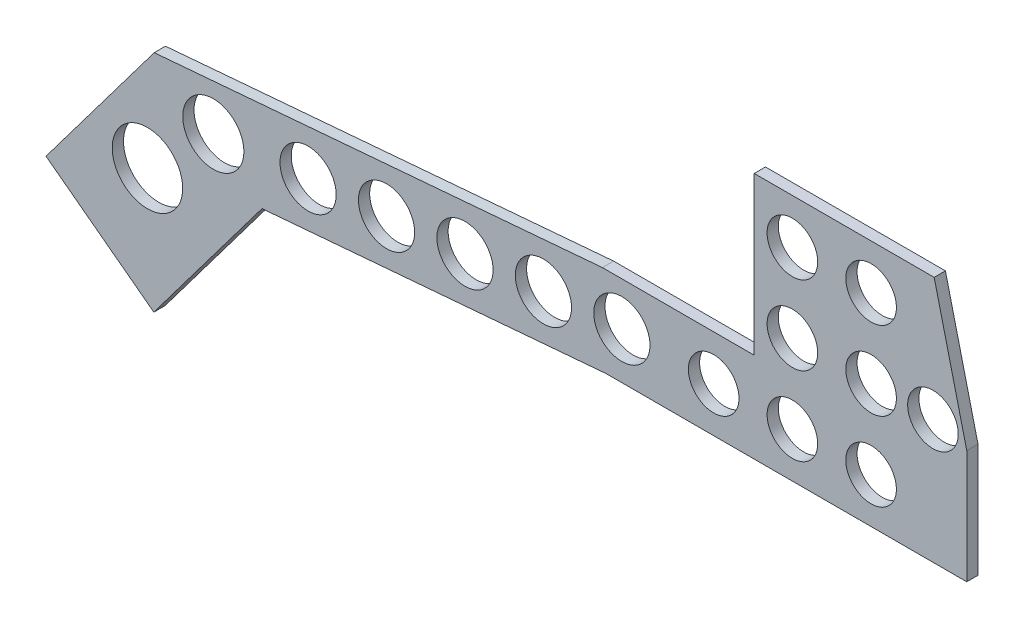
ISO-10303-21;
HEADER;
FILE_DESCRIPTION(('STEP AP214'),'2;1');
FILE_NAME('part.step','',(''),(''),'','','');
FILE_SCHEMA(('AUTOMOTIVE_DESIGN { 1 0 10303 214 1 1 1 1 }'));
ENDSEC;
DATA;
#1=APPLICATION_CONTEXT('core data for automotive mechanical design processes');
#2=APPLICATION_PROTOCOL_DEFINITION('international standard','automotive_design',2000,#1);
#3=PRODUCT_CONTEXT('',#1,'mechanical');
#4=PRODUCT('Part','Part','',(#3));
#5=PRODUCT_RELATED_PRODUCT_CATEGORY('part','',(#4));
#6=PRODUCT_DEFINITION_FORMATION('','',#4);
#7=PRODUCT_DEFINITION_CONTEXT('part definition',#1,'design');
#8=PRODUCT_DEFINITION('design','',#6,#7);
#9=PRODUCT_DEFINITION_SHAPE('','',#8);
#10=(LENGTH_UNIT() NAMED_UNIT(*) SI_UNIT(.MILLI.,.METRE.));
#11=(NAMED_UNIT(*) PLANE_ANGLE_UNIT() SI_UNIT($,.RADIAN.));
#12=(NAMED_UNIT(*) SI_UNIT($,.STERADIAN.) SOLID_ANGLE_UNIT());
#13=UNCERTAINTY_MEASURE_WITH_UNIT(LENGTH_MEASURE(1.E-05),#10,'distance_accuracy_value','');
#14=(GEOMETRIC_REPRESENTATION_CONTEXT(3) GLOBAL_UNCERTAINTY_ASSIGNED_CONTEXT((#13)) GLOBAL_UNIT_ASSIGNED_CONTEXT((#10,
#11,#12)) REPRESENTATION_CONTEXT('',''));
#15=CARTESIAN_POINT('',(0.,0.,0.));
#16=DIRECTION('',(0.,0.,1.));
#17=DIRECTION('',(1.,0.,0.));
#18=AXIS2_PLACEMENT_3D('',#15,#16,#17);
#19=CARTESIAN_POINT('',(-169.514196693188,-118.676834610208,3.175));
#20=DIRECTION('',(-0.601328641816421,-0.799001792570716,0.));
#21=DIRECTION('',(0.799001792570717,-0.601328641816421,0.));
#22=AXIS2_PLACEMENT_3D('',#19,#20,#21);
#23=PLANE('',#22);
#24=DIRECTION('',(-0.799001792570716,0.601328641816421,0.));
#25=VECTOR('',#24,1.);
#26=CARTESIAN_POINT('',(-169.514196693188,-118.676834610208,0.));
#27=LINE('',#26,#25);
#28=CARTESIAN_POINT('',(-169.514196693188,-118.676834610208,0.));
#29=VERTEX_POINT('',#28);
#30=CARTESIAN_POINT('',(-199.956164990132,-95.7662133570028,0.));
#31=VERTEX_POINT('',#30);
#32=EDGE_CURVE('E151',#29,#31,#27,.T.);
#33=ORIENTED_EDGE('',*,*,#32,.F.);
#34=DIRECTION('',(0.,0.,-1.));
#35=VECTOR('',#34,1.);
#36=CARTESIAN_POINT('',(-169.514196693188,-118.676834610208,3.175));
#37=LINE('',#36,#35);
#38=CARTESIAN_POINT('',(-169.514196693188,-118.676834610208,3.175));
#39=VERTEX_POINT('',#38);
#40=EDGE_CURVE('E11',#39,#29,#37,.T.);
#41=ORIENTED_EDGE('',*,*,#40,.F.);
#42=DIRECTION('',(-0.799001792570716,0.601328641816421,0.));
#43=VECTOR('',#42,1.);
#44=CARTESIAN_POINT('',(-169.514196693188,-118.676834610208,3.175));
#45=LINE('',#44,#43);
#46=CARTESIAN_POINT('',(-199.956164990132,-95.7662133570028,3.175));
#47=VERTEX_POINT('',#46);
#48=EDGE_CURVE('E181',#39,#47,#45,.T.);
#49=ORIENTED_EDGE('',*,*,#48,.T.);
#50=DIRECTION('',(0.,0.,-1.));
#51=VECTOR('',#50,1.);
#52=CARTESIAN_POINT('',(-199.956164990132,-95.7662133570028,3.175));
#53=LINE('',#52,#51);
#54=EDGE_CURVE('E39',#47,#31,#53,.T.);
#55=ORIENTED_EDGE('',*,*,#54,.T.);
#56=EDGE_LOOP('',(#33,#41,#49,#55));
#57=FACE_BOUND('',#56,.T.);
#58=ADVANCED_FACE('F36',(#57),#23,.T.);
#59=CARTESIAN_POINT('',(-138.966701688914,-78.087543547616,3.175));
#60=DIRECTION('',(0.799001792570717,-0.601328641816421,0.));
#61=DIRECTION('',(0.601328641816421,0.799001792570717,0.));
#62=AXIS2_PLACEMENT_3D('',#59,#60,#61);
#63=PLANE('',#62);
#64=DIRECTION('',(-0.601328641816421,-0.799001792570717,0.));
#65=VECTOR('',#64,1.);
#66=CARTESIAN_POINT('',(-138.966701688914,-78.087543547616,0.));
#67=LINE('',#66,#65);
#68=CARTESIAN_POINT('',(-138.966701688914,-78.087543547616,0.));
#69=VERTEX_POINT('',#68);
#70=EDGE_CURVE('E179',#69,#29,#67,.T.);
#71=ORIENTED_EDGE('',*,*,#70,.F.);
#72=DIRECTION('',(0.,0.,-1.));
#73=VECTOR('',#72,1.);
#74=CARTESIAN_POINT('',(-138.966701688914,-78.087543547616,3.175));
#75=LINE('',#74,#73);
#76=CARTESIAN_POINT('',(-138.966701688914,-78.087543547616,3.175));
#77=VERTEX_POINT('',#76);
#78=EDGE_CURVE('E45',#77,#69,#75,.T.);
#79=ORIENTED_EDGE('',*,*,#78,.F.);
#80=DIRECTION('',(-0.601328641816421,-0.799001792570717,0.));
#81=VECTOR('',#80,1.);
#82=CARTESIAN_POINT('',(-138.966701688914,-78.087543547616,3.175));
#83=LINE('',#82,#81);
#84=EDGE_CURVE('E141',#77,#39,#83,.T.);
#85=ORIENTED_EDGE('',*,*,#84,.T.);
#86=ORIENTED_EDGE('',*,*,#40,.T.);
#87=EDGE_LOOP('',(#71,#79,#85,#86));
#88=FACE_BOUND('',#87,.T.);
#89=ADVANCED_FACE('F199',(#88),#63,.T.);
#90=CARTESIAN_POINT('',(-41.787887726057,-69.85,3.175));
#91=DIRECTION('',(0.0844639550740975,-0.996426535321717,0.));
#92=DIRECTION('',(0.996426535321717,0.0844639550740975,0.));
#93=AXIS2_PLACEMENT_3D('',#90,#91,#92);
#94=PLANE('',#93);
#95=DIRECTION('',(-0.996426535321717,-0.0844639550740975,0.));
#96=VECTOR('',#95,1.);
#97=CARTESIAN_POINT('',(-41.787887726057,-69.85,0.));
#98=LINE('',#97,#96);
#99=CARTESIAN_POINT('',(-41.787887726057,-69.85,0.));
#100=VERTEX_POINT('',#99);
#101=EDGE_CURVE('E128',#100,#69,#98,.T.);
#102=ORIENTED_EDGE('',*,*,#101,.F.);
#103=DIRECTION('',(0.,0.,-1.));
#104=VECTOR('',#103,1.);
#105=CARTESIAN_POINT('',(-41.787887726057,-69.85,3.175));
#106=LINE('',#105,#104);
#107=CARTESIAN_POINT('',(-41.787887726057,-69.85,3.175));
#108=VERTEX_POINT('',#107);
#109=EDGE_CURVE('E123',#108,#100,#106,.T.);
#110=ORIENTED_EDGE('',*,*,#109,.F.);
#111=DIRECTION('',(-0.996426535321717,-0.0844639550740975,0.));
#112=VECTOR('',#111,1.);
#113=CARTESIAN_POINT('',(-41.787887726057,-69.85,3.175));
#114=LINE('',#113,#112);
#115=EDGE_CURVE('E126',#108,#77,#114,.T.);
#116=ORIENTED_EDGE('',*,*,#115,.T.);
#117=ORIENTED_EDGE('',*,*,#78,.T.);
#118=EDGE_LOOP('',(#102,#110,#116,#117));
#119=FACE_BOUND('',#118,.T.);
#120=ADVANCED_FACE('F125',(#119),#94,.T.);
#121=CARTESIAN_POINT('',(60.,-69.85,3.175));
#122=DIRECTION('',(0.,-1.,0.));
#123=DIRECTION('',(0.,0.,-1.));
#124=AXIS2_PLACEMENT_3D('',#121,#122,#123);
#125=PLANE('',#124);
#126=DIRECTION('',(-1.,0.,0.));
#127=VECTOR('',#126,1.);
#128=CARTESIAN_POINT('',(60.,-69.85,0.));
#129=LINE('',#128,#127);
#130=CARTESIAN_POINT('',(60.,-69.85,0.));
#131=VERTEX_POINT('',#130);
#132=EDGE_CURVE('E176',#131,#100,#129,.T.);
#133=ORIENTED_EDGE('',*,*,#132,.F.);
#134=DIRECTION('',(0.,0.,-1.));
#135=VECTOR('',#134,1.);
#136=CARTESIAN_POINT('',(60.,-69.85,3.175));
#137=LINE('',#136,#135);
#138=CARTESIAN_POINT('',(60.,-69.85,3.175));
#139=VERTEX_POINT('',#138);
#140=EDGE_CURVE('E133',#139,#131,#137,.T.);
#141=ORIENTED_EDGE('',*,*,#140,.F.);
#142=DIRECTION('',(-1.,0.,0.));
#143=VECTOR('',#142,1.);
#144=CARTESIAN_POINT('',(60.,-69.85,3.175));
#145=LINE('',#144,#143);
#146=EDGE_CURVE('E139',#139,#108,#145,.T.);
#147=ORIENTED_EDGE('',*,*,#146,.T.);
#148=ORIENTED_EDGE('',*,*,#109,.T.);
#149=EDGE_LOOP('',(#133,#141,#147,#148));
#150=FACE_BOUND('',#149,.T.);
#151=ADVANCED_FACE('F143',(#150),#125,.T.);
#152=CARTESIAN_POINT('',(60.,-37.7540856031128,3.175));
#153=DIRECTION('',(1.,0.,0.));
#154=DIRECTION('',(0.,1.,0.));
#155=AXIS2_PLACEMENT_3D('',#152,#153,#154);
#156=PLANE('',#155);
#157=DIRECTION('',(0.,-1.,0.));
#158=VECTOR('',#157,1.);
#159=CARTESIAN_POINT('',(60.,-37.7540856031128,0.));
#160=LINE('',#159,#158);
#161=CARTESIAN_POINT('',(60.,-37.7540856031128,0.));
#162=VERTEX_POINT('',#161);
#163=EDGE_CURVE('E173',#162,#131,#160,.T.);
#164=ORIENTED_EDGE('',*,*,#163,.F.);
#165=DIRECTION('',(0.,0.,-1.));
#166=VECTOR('',#165,1.);
#167=CARTESIAN_POINT('',(60.,-37.7540856031128,3.175));
#168=LINE('',#167,#166);
#169=CARTESIAN_POINT('',(60.,-37.7540856031128,3.175));
#170=VERTEX_POINT('',#169);
#171=EDGE_CURVE('E185',#170,#162,#168,.T.);
#172=ORIENTED_EDGE('',*,*,#171,.F.);
#173=DIRECTION('',(0.,-1.,0.));
#174=VECTOR('',#173,1.);
#175=CARTESIAN_POINT('',(60.,-37.7540856031128,3.175));
#176=LINE('',#175,#174);
#177=EDGE_CURVE('E144',#170,#139,#176,.T.);
#178=ORIENTED_EDGE('',*,*,#177,.T.);
#179=ORIENTED_EDGE('',*,*,#140,.T.);
#180=EDGE_LOOP('',(#164,#172,#178,#179));
#181=FACE_BOUND('',#180,.T.);
#182=ADVANCED_FACE('F212',(#181),#156,.T.);
#183=CARTESIAN_POINT('',(50.8,0.,3.175));
#184=DIRECTION('',(0.971569569019637,0.236754245062253,0.));
#185=DIRECTION('',(-0.236754245062253,0.971569569019637,0.));
#186=AXIS2_PLACEMENT_3D('',#183,#184,#185);
#187=PLANE('',#186);
#188=DIRECTION('',(0.236754245062253,-0.971569569019637,0.));
#189=VECTOR('',#188,1.);
#190=CARTESIAN_POINT('',(50.8,0.,0.));
#191=LINE('',#190,#189);
#192=CARTESIAN_POINT('',(50.8,0.,0.));
#193=VERTEX_POINT('',#192);
#194=EDGE_CURVE('E170',#193,#162,#191,.T.);
#195=ORIENTED_EDGE('',*,*,#194,.F.);
#196=DIRECTION('',(0.,0.,-1.));
#197=VECTOR('',#196,1.);
#198=CARTESIAN_POINT('',(50.8,0.,3.175));
#199=LINE('',#198,#197);
#200=CARTESIAN_POINT('',(50.8,0.,3.175));
#201=VERTEX_POINT('',#200);
#202=EDGE_CURVE('E187',#201,#193,#199,.T.);
#203=ORIENTED_EDGE('',*,*,#202,.F.);
#204=DIRECTION('',(0.236754245062253,-0.971569569019637,0.));
#205=VECTOR('',#204,1.);
#206=CARTESIAN_POINT('',(50.8,0.,3.175));
#207=LINE('',#206,#205);
#208=EDGE_CURVE('E146',#201,#170,#207,.T.);
#209=ORIENTED_EDGE('',*,*,#208,.T.);
#210=ORIENTED_EDGE('',*,*,#171,.T.);
#211=EDGE_LOOP('',(#195,#203,#209,#210));
#212=FACE_BOUND('',#211,.T.);
#213=ADVANCED_FACE('F215',(#212),#187,.T.);
#214=CARTESIAN_POINT('',(0.,0.,3.175));
#215=DIRECTION('',(0.,1.,0.));
#216=DIRECTION('',(0.,0.,1.));
#217=AXIS2_PLACEMENT_3D('',#214,#215,#216);
#218=PLANE('',#217);
#219=DIRECTION('',(1.,0.,0.));
#220=VECTOR('',#219,1.);
#221=CARTESIAN_POINT('',(0.,0.,0.));
#222=LINE('',#221,#220);
#223=CARTESIAN_POINT('',(0.,0.,0.));
#224=VERTEX_POINT('',#223);
#225=EDGE_CURVE('E167',#224,#193,#222,.T.);
#226=ORIENTED_EDGE('',*,*,#225,.F.);
#227=DIRECTION('',(0.,0.,-1.));
#228=VECTOR('',#227,1.);
#229=CARTESIAN_POINT('',(0.,0.,3.175));
#230=LINE('',#229,#228);
#231=CARTESIAN_POINT('',(0.,0.,3.175));
#232=VERTEX_POINT('',#231);
#233=EDGE_CURVE('E189',#232,#224,#230,.T.);
#234=ORIENTED_EDGE('',*,*,#233,.F.);
#235=DIRECTION('',(1.,0.,0.));
#236=VECTOR('',#235,1.);
#237=CARTESIAN_POINT('',(0.,0.,3.175));
#238=LINE('',#237,#236);
#239=EDGE_CURVE('E412',#232,#201,#238,.T.);
#240=ORIENTED_EDGE('',*,*,#239,.T.);
#241=ORIENTED_EDGE('',*,*,#202,.T.);
#242=EDGE_LOOP('',(#226,#234,#240,#241));
#243=FACE_BOUND('',#242,.T.);
#244=ADVANCED_FACE('F219',(#243),#218,.T.);
#245=CARTESIAN_POINT('',(0.,-44.45,3.175));
#246=DIRECTION('',(-1.,0.,0.));
#247=DIRECTION('',(0.,-1.,0.));
#248=AXIS2_PLACEMENT_3D('',#245,#246,#247);
#249=PLANE('',#248);
#250=DIRECTION('',(0.,1.,0.));
#251=VECTOR('',#250,1.);
#252=CARTESIAN_POINT('',(0.,-44.45,0.));
#253=LINE('',#252,#251);
#254=CARTESIAN_POINT('',(0.,-44.45,0.));
#255=VERTEX_POINT('',#254);
#256=EDGE_CURVE('E164',#255,#224,#253,.T.);
#257=ORIENTED_EDGE('',*,*,#256,.F.);
#258=DIRECTION('',(0.,0.,-1.));
#259=VECTOR('',#258,1.);
#260=CARTESIAN_POINT('',(0.,-44.45,3.175));
#261=LINE('',#260,#259);
#262=CARTESIAN_POINT('',(0.,-44.45,3.175));
#263=VERTEX_POINT('',#262);
#264=EDGE_CURVE('E191',#263,#255,#261,.T.);
#265=ORIENTED_EDGE('',*,*,#264,.F.);
#266=DIRECTION('',(0.,1.,0.));
#267=VECTOR('',#266,1.);
#268=CARTESIAN_POINT('',(0.,-44.45,3.175));
#269=LINE('',#268,#267);
#270=EDGE_CURVE('E409',#263,#232,#269,.T.);
#271=ORIENTED_EDGE('',*,*,#270,.T.);
#272=ORIENTED_EDGE('',*,*,#233,.T.);
#273=EDGE_LOOP('',(#257,#265,#271,#272));
#274=FACE_BOUND('',#273,.T.);
#275=ADVANCED_FACE('F223',(#274),#249,.T.);
#276=CARTESIAN_POINT('',(-42.8625,-44.45,3.175));
#277=DIRECTION('',(0.,1.,0.));
#278=DIRECTION('',(0.,0.,1.));
#279=AXIS2_PLACEMENT_3D('',#276,#277,#278);
#280=PLANE('',#279);
#281=DIRECTION('',(1.,0.,0.));
#282=VECTOR('',#281,1.);
#283=CARTESIAN_POINT('',(-42.8625,-44.45,0.));
#284=LINE('',#283,#282);
#285=CARTESIAN_POINT('',(-42.8625,-44.45,0.));
#286=VERTEX_POINT('',#285);
#287=EDGE_CURVE('E161',#286,#255,#284,.T.);
#288=ORIENTED_EDGE('',*,*,#287,.F.);
#289=DIRECTION('',(0.,0.,-1.));
#290=VECTOR('',#289,1.);
#291=CARTESIAN_POINT('',(-42.8625,-44.45,3.175));
#292=LINE('',#291,#290);
#293=CARTESIAN_POINT('',(-42.8625,-44.45,3.175));
#294=VERTEX_POINT('',#293);
#295=EDGE_CURVE('E193',#294,#286,#292,.T.);
#296=ORIENTED_EDGE('',*,*,#295,.F.);
#297=DIRECTION('',(1.,0.,0.));
#298=VECTOR('',#297,1.);
#299=CARTESIAN_POINT('',(-42.8625,-44.45,3.175));
#300=LINE('',#299,#298);
#301=EDGE_CURVE('E406',#294,#263,#300,.T.);
#302=ORIENTED_EDGE('',*,*,#301,.T.);
#303=ORIENTED_EDGE('',*,*,#264,.T.);
#304=EDGE_LOOP('',(#288,#296,#302,#303));
#305=FACE_BOUND('',#304,.T.);
#306=ADVANCED_FACE('F227',(#305),#280,.T.);
#307=CARTESIAN_POINT('',(-169.408669985858,-55.1769222944104,3.175));
#308=DIRECTION('',(-0.0844639550740974,0.996426535321717,0.));
#309=DIRECTION('',(-0.996426535321717,-0.0844639550740974,0.));
#310=AXIS2_PLACEMENT_3D('',#307,#308,#309);
#311=PLANE('',#310);
#312=DIRECTION('',(0.996426535321717,0.0844639550740974,0.));
#313=VECTOR('',#312,1.);
#314=CARTESIAN_POINT('',(-169.408669985858,-55.1769222944104,0.));
#315=LINE('',#314,#313);
#316=CARTESIAN_POINT('',(-169.408669985858,-55.1769222944104,0.));
#317=VERTEX_POINT('',#316);
#318=EDGE_CURVE('E158',#317,#286,#315,.T.);
#319=ORIENTED_EDGE('',*,*,#318,.F.);
#320=DIRECTION('',(0.,0.,-1.));
#321=VECTOR('',#320,1.);
#322=CARTESIAN_POINT('',(-169.408669985858,-55.1769222944104,3.175));
#323=LINE('',#322,#321);
#324=CARTESIAN_POINT('',(-169.408669985858,-55.1769222944104,3.175));
#325=VERTEX_POINT('',#324);
#326=EDGE_CURVE('E194',#325,#317,#323,.T.);
#327=ORIENTED_EDGE('',*,*,#326,.F.);
#328=DIRECTION('',(0.996426535321717,0.0844639550740974,0.));
#329=VECTOR('',#328,1.);
#330=CARTESIAN_POINT('',(-169.408669985858,-55.1769222944104,3.175));
#331=LINE('',#330,#329);
#332=EDGE_CURVE('E403',#325,#294,#331,.T.);
#333=ORIENTED_EDGE('',*,*,#332,.T.);
#334=ORIENTED_EDGE('',*,*,#295,.T.);
#335=EDGE_LOOP('',(#319,#327,#333,#334));
#336=FACE_BOUND('',#335,.T.);
#337=ADVANCED_FACE('F231',(#336),#311,.T.);
#338=CARTESIAN_POINT('',(-199.956164990132,-95.7662133570028,3.175));
#339=DIRECTION('',(-0.799001792570716,0.601328641816421,0.));
#340=DIRECTION('',(-0.601328641816421,-0.799001792570716,0.));
#341=AXIS2_PLACEMENT_3D('',#338,#339,#340);
#342=PLANE('',#341);
#343=DIRECTION('',(0.601328641816421,0.799001792570716,0.));
#344=VECTOR('',#343,1.);
#345=CARTESIAN_POINT('',(-199.956164990132,-95.7662133570028,0.));
#346=LINE('',#345,#344);
#347=EDGE_CURVE('E154',#31,#317,#346,.T.);
#348=ORIENTED_EDGE('',*,*,#347,.F.);
#349=ORIENTED_EDGE('',*,*,#54,.F.);
#350=DIRECTION('',(0.601328641816421,0.799001792570716,0.));
#351=VECTOR('',#350,1.);
#352=CARTESIAN_POINT('',(-199.956164990132,-95.7662133570028,3.175));
#353=LINE('',#352,#351);
#354=EDGE_CURVE('E401',#47,#325,#353,.T.);
#355=ORIENTED_EDGE('',*,*,#354,.T.);
#356=ORIENTED_EDGE('',*,*,#326,.T.);
#357=EDGE_LOOP('',(#348,#349,#355,#356));
#358=FACE_BOUND('',#357,.T.);
#359=ADVANCED_FACE('F196',(#358),#342,.T.);
#360=CARTESIAN_POINT('',(0.,0.,3.175));
#361=DIRECTION('',(0.,0.,-1.));
#362=DIRECTION('',(-1.,0.,0.));
#363=AXIS2_PLACEMENT_3D('',#360,#361,#362);
#364=PLANE('',#363);
#365=CARTESIAN_POINT('',(-171.31481467954,-84.3519144898795,3.175));
#366=DIRECTION('',(0.,0.,1.));
#367=DIRECTION('',(1.,0.,0.));
#368=AXIS2_PLACEMENT_3D('',#365,#366,#367);
#369=CIRCLE('',#368,9.94643270937823);
#370=CARTESIAN_POINT('',(-161.368381970162,-84.3519144898795,3.175));
#371=VERTEX_POINT('',#370);
#372=EDGE_CURVE('E312',#371,#371,#369,.T.);
#373=ORIENTED_EDGE('',*,*,#372,.F.);
#374=EDGE_LOOP('',(#373));
#375=FACE_BOUND('',#374,.T.);
#376=CARTESIAN_POINT('',(10.7698192880506,-12.7,3.175));
#377=DIRECTION('',(0.,0.,1.));
#378=DIRECTION('',(1.,0.,0.));
#379=AXIS2_PLACEMENT_3D('',#376,#377,#378);
#380=CIRCLE('',#379,7.14375);
#381=CARTESIAN_POINT('',(17.9135692880506,-12.7,3.175));
#382=VERTEX_POINT('',#381);
#383=EDGE_CURVE('E340',#382,#382,#380,.T.);
#384=ORIENTED_EDGE('',*,*,#383,.F.);
#385=EDGE_LOOP('',(#384));
#386=FACE_BOUND('',#385,.T.);
#387=CARTESIAN_POINT('',(32.9948192880506,-34.925,3.175));
#388=DIRECTION('',(0.,0.,1.));
#389=DIRECTION('',(1.,0.,0.));
#390=AXIS2_PLACEMENT_3D('',#387,#388,#389);
#391=CIRCLE('',#390,7.14375);
#392=CARTESIAN_POINT('',(40.1385692880506,-34.925,3.175));
#393=VERTEX_POINT('',#392);
#394=EDGE_CURVE('E333',#393,#393,#391,.T.);
#395=ORIENTED_EDGE('',*,*,#394,.F.);
#396=EDGE_LOOP('',(#395));
#397=FACE_BOUND('',#396,.T.);
#398=CARTESIAN_POINT('',(10.7698192880506,-34.925,3.175));
#399=DIRECTION('',(0.,0.,1.));
#400=DIRECTION('',(1.,0.,0.));
#401=AXIS2_PLACEMENT_3D('',#398,#399,#400);
#402=CIRCLE('',#401,7.14375);
#403=CARTESIAN_POINT('',(17.9135692880506,-34.925,3.175));
#404=VERTEX_POINT('',#403);
#405=EDGE_CURVE('E352',#404,#404,#402,.T.);
#406=ORIENTED_EDGE('',*,*,#405,.F.);
#407=EDGE_LOOP('',(#406));
#408=FACE_BOUND('',#407,.T.);
#409=CARTESIAN_POINT('',(32.9948192880507,-57.15,3.175));
#410=DIRECTION('',(0.,0.,1.));
#411=DIRECTION('',(1.,0.,0.));
#412=AXIS2_PLACEMENT_3D('',#409,#410,#411);
#413=CIRCLE('',#412,7.14375);
#414=CARTESIAN_POINT('',(40.1385692880507,-57.15,3.175));
#415=VERTEX_POINT('',#414);
#416=EDGE_CURVE('E345',#415,#415,#413,.T.);
#417=ORIENTED_EDGE('',*,*,#416,.F.);
#418=EDGE_LOOP('',(#417));
#419=FACE_BOUND('',#418,.T.);
#420=CARTESIAN_POINT('',(50.4573192880506,-34.925,3.175));
#421=DIRECTION('',(0.,0.,1.));
#422=DIRECTION('',(1.,0.,0.));
#423=AXIS2_PLACEMENT_3D('',#420,#421,#422);
#424=CIRCLE('',#423,7.14375000000002);
#425=CARTESIAN_POINT('',(57.6010692880507,-34.925,3.175));
#426=VERTEX_POINT('',#425);
#427=EDGE_CURVE('E320',#426,#426,#424,.T.);
#428=ORIENTED_EDGE('',*,*,#427,.F.);
#429=EDGE_LOOP('',(#428));
#430=FACE_BOUND('',#429,.T.);
#431=CARTESIAN_POINT('',(32.9948192880506,-12.7,3.175));
#432=DIRECTION('',(0.,0.,1.));
#433=DIRECTION('',(1.,0.,0.));
#434=AXIS2_PLACEMENT_3D('',#431,#432,#433);
#435=CIRCLE('',#434,7.14375);
#436=CARTESIAN_POINT('',(40.1385692880506,-12.7,3.175));
#437=VERTEX_POINT('',#436);
#438=EDGE_CURVE('E327',#437,#437,#435,.T.);
#439=ORIENTED_EDGE('',*,*,#438,.F.);
#440=EDGE_LOOP('',(#439));
#441=FACE_BOUND('',#440,.T.);
#442=CARTESIAN_POINT('',(10.7698192880507,-57.15,3.175));
#443=DIRECTION('',(0.,0.,1.));
#444=DIRECTION('',(1.,0.,0.));
#445=AXIS2_PLACEMENT_3D('',#442,#443,#444);
#446=CIRCLE('',#445,7.14375);
#447=CARTESIAN_POINT('',(17.9135692880507,-57.15,3.175));
#448=VERTEX_POINT('',#447);
#449=EDGE_CURVE('E395',#448,#448,#446,.T.);
#450=ORIENTED_EDGE('',*,*,#449,.F.);
#451=EDGE_LOOP('',(#450));
#452=FACE_BOUND('',#451,.T.);
#453=CARTESIAN_POINT('',(-11.4551807119493,-57.15,3.175));
#454=DIRECTION('',(0.,0.,1.));
#455=DIRECTION('',(1.,0.,0.));
#456=AXIS2_PLACEMENT_3D('',#453,#454,#455);
#457=CIRCLE('',#456,7.14375);
#458=CARTESIAN_POINT('',(-4.31143071194928,-57.15,3.175));
#459=VERTEX_POINT('',#458);
#460=EDGE_CURVE('E389',#459,#459,#457,.T.);
#461=ORIENTED_EDGE('',*,*,#460,.F.);
#462=EDGE_LOOP('',(#461));
#463=FACE_BOUND('',#462,.T.);
#464=CARTESIAN_POINT('',(-37.3751295424516,-56.7303985586833,3.175));
#465=DIRECTION('',(0.,0.,1.));
#466=DIRECTION('',(1.,0.,0.));
#467=AXIS2_PLACEMENT_3D('',#464,#465,#466);
#468=CIRCLE('',#467,7.9375);
#469=CARTESIAN_POINT('',(-29.4376295424516,-56.7303985586833,3.175));
#470=VERTEX_POINT('',#469);
#471=EDGE_CURVE('E383',#470,#470,#468,.T.);
#472=ORIENTED_EDGE('',*,*,#471,.F.);
#473=EDGE_LOOP('',(#472));
#474=FACE_BOUND('',#473,.T.);
#475=CARTESIAN_POINT('',(-59.5207092895882,-58.6076099601722,3.175));
#476=DIRECTION('',(0.,0.,1.));
#477=DIRECTION('',(1.,0.,0.));
#478=AXIS2_PLACEMENT_3D('',#475,#476,#477);
#479=CIRCLE('',#478,7.9375);
#480=CARTESIAN_POINT('',(-51.5832092895882,-58.6076099601722,3.175));
#481=VERTEX_POINT('',#480);
#482=EDGE_CURVE('E377',#481,#481,#479,.T.);
#483=ORIENTED_EDGE('',*,*,#482,.F.);
#484=EDGE_LOOP('',(#483));
#485=FACE_BOUND('',#484,.T.);
#486=CARTESIAN_POINT('',(-81.6662890367248,-60.4848213616611,3.175));
#487=DIRECTION('',(0.,0.,1.));
#488=DIRECTION('',(1.,0.,0.));
#489=AXIS2_PLACEMENT_3D('',#486,#487,#488);
#490=CIRCLE('',#489,7.93749999999999);
#491=CARTESIAN_POINT('',(-73.7287890367248,-60.4848213616611,3.175));
#492=VERTEX_POINT('',#491);
#493=EDGE_CURVE('E371',#492,#492,#490,.T.);
#494=ORIENTED_EDGE('',*,*,#493,.F.);
#495=EDGE_LOOP('',(#494));
#496=FACE_BOUND('',#495,.T.);
#497=CARTESIAN_POINT('',(-103.811868783861,-62.36203276315,3.175));
#498=DIRECTION('',(0.,0.,1.));
#499=DIRECTION('',(1.,0.,0.));
#500=AXIS2_PLACEMENT_3D('',#497,#498,#499);
#501=CIRCLE('',#500,7.93749999999999);
#502=CARTESIAN_POINT('',(-95.8743687838615,-62.36203276315,3.175));
#503=VERTEX_POINT('',#502);
#504=EDGE_CURVE('E365',#503,#503,#501,.T.);
#505=ORIENTED_EDGE('',*,*,#504,.F.);
#506=EDGE_LOOP('',(#505));
#507=FACE_BOUND('',#506,.T.);
#508=CARTESIAN_POINT('',(-125.957448530998,-64.2392441646389,3.175));
#509=DIRECTION('',(0.,0.,1.));
#510=DIRECTION('',(1.,0.,0.));
#511=AXIS2_PLACEMENT_3D('',#508,#509,#510);
#512=CIRCLE('',#511,7.93749999999999);
#513=CARTESIAN_POINT('',(-118.019948530998,-64.2392441646389,3.175));
#514=VERTEX_POINT('',#513);
#515=EDGE_CURVE('E359',#514,#514,#512,.T.);
#516=ORIENTED_EDGE('',*,*,#515,.F.);
#517=EDGE_LOOP('',(#516));
#518=FACE_BOUND('',#517,.T.);
#519=CARTESIAN_POINT('',(-152.715034721631,-66.7141921159995,3.175));
#520=DIRECTION('',(0.,0.,1.));
#521=DIRECTION('',(1.,0.,0.));
#522=AXIS2_PLACEMENT_3D('',#519,#520,#521);
#523=CIRCLE('',#522,8.62877403144879);
#524=CARTESIAN_POINT('',(-144.086260690182,-66.7141921159995,3.175));
#525=VERTEX_POINT('',#524);
#526=EDGE_CURVE('E313',#525,#525,#523,.T.);
#527=ORIENTED_EDGE('',*,*,#526,.F.);
#528=EDGE_LOOP('',(#527));
#529=FACE_BOUND('',#528,.T.);
#530=ORIENTED_EDGE('',*,*,#48,.F.);
#531=ORIENTED_EDGE('',*,*,#84,.F.);
#532=ORIENTED_EDGE('',*,*,#115,.F.);
#533=ORIENTED_EDGE('',*,*,#146,.F.);
#534=ORIENTED_EDGE('',*,*,#177,.F.);
#535=ORIENTED_EDGE('',*,*,#208,.F.);
#536=ORIENTED_EDGE('',*,*,#239,.F.);
#537=ORIENTED_EDGE('',*,*,#270,.F.);
#538=ORIENTED_EDGE('',*,*,#301,.F.);
#539=ORIENTED_EDGE('',*,*,#332,.F.);
#540=ORIENTED_EDGE('',*,*,#354,.F.);
#541=EDGE_LOOP('',(#530,#531,#532,#533,#534,#535,#536,#537,#538,#539,#540));
#542=FACE_BOUND('',#541,.T.);
#543=ADVANCED_FACE('F137',(#375,#386,#397,#408,#419,#430,#441,#452,#463,#474,#485,#496,#507,
#518,#529,#542),#364,.F.);
#544=CARTESIAN_POINT('',(0.,0.,0.));
#545=DIRECTION('',(0.,0.,-1.));
#546=DIRECTION('',(-1.,0.,0.));
#547=AXIS2_PLACEMENT_3D('',#544,#545,#546);
#548=PLANE('',#547);
#549=CARTESIAN_POINT('',(-171.31481467954,-84.3519144898795,0.));
#550=DIRECTION('',(0.,0.,1.));
#551=DIRECTION('',(1.,0.,0.));
#552=AXIS2_PLACEMENT_3D('',#549,#550,#551);
#553=CIRCLE('',#552,9.94643270937823);
#554=CARTESIAN_POINT('',(-161.368381970162,-84.3519144898795,0.));
#555=VERTEX_POINT('',#554);
#556=EDGE_CURVE('E155',#555,#555,#553,.T.);
#557=ORIENTED_EDGE('',*,*,#556,.T.);
#558=EDGE_LOOP('',(#557));
#559=FACE_BOUND('',#558,.T.);
#560=CARTESIAN_POINT('',(10.7698192880506,-12.7,0.));
#561=DIRECTION('',(0.,0.,1.));
#562=DIRECTION('',(1.,0.,0.));
#563=AXIS2_PLACEMENT_3D('',#560,#561,#562);
#564=CIRCLE('',#563,7.14375);
#565=CARTESIAN_POINT('',(17.9135692880506,-12.7,0.));
#566=VERTEX_POINT('',#565);
#567=EDGE_CURVE('E330',#566,#566,#564,.T.);
#568=ORIENTED_EDGE('',*,*,#567,.T.);
#569=EDGE_LOOP('',(#568));
#570=FACE_BOUND('',#569,.T.);
#571=CARTESIAN_POINT('',(32.9948192880506,-34.925,0.));
#572=DIRECTION('',(0.,0.,1.));
#573=DIRECTION('',(1.,0.,0.));
#574=AXIS2_PLACEMENT_3D('',#571,#572,#573);
#575=CIRCLE('',#574,7.14375);
#576=CARTESIAN_POINT('',(40.1385692880506,-34.925,0.));
#577=VERTEX_POINT('',#576);
#578=EDGE_CURVE('E337',#577,#577,#575,.T.);
#579=ORIENTED_EDGE('',*,*,#578,.T.);
#580=EDGE_LOOP('',(#579));
#581=FACE_BOUND('',#580,.T.);
#582=CARTESIAN_POINT('',(10.7698192880506,-34.925,0.));
#583=DIRECTION('',(0.,0.,1.));
#584=DIRECTION('',(1.,0.,0.));
#585=AXIS2_PLACEMENT_3D('',#582,#583,#584);
#586=CIRCLE('',#585,7.14375);
#587=CARTESIAN_POINT('',(17.9135692880506,-34.925,0.));
#588=VERTEX_POINT('',#587);
#589=EDGE_CURVE('E336',#588,#588,#586,.T.);
#590=ORIENTED_EDGE('',*,*,#589,.T.);
#591=EDGE_LOOP('',(#590));
#592=FACE_BOUND('',#591,.T.);
#593=CARTESIAN_POINT('',(32.9948192880507,-57.15,0.));
#594=DIRECTION('',(0.,0.,1.));
#595=DIRECTION('',(1.,0.,0.));
#596=AXIS2_PLACEMENT_3D('',#593,#594,#595);
#597=CIRCLE('',#596,7.14375);
#598=CARTESIAN_POINT('',(40.1385692880507,-57.15,0.));
#599=VERTEX_POINT('',#598);
#600=EDGE_CURVE('E349',#599,#599,#597,.T.);
#601=ORIENTED_EDGE('',*,*,#600,.T.);
#602=EDGE_LOOP('',(#601));
#603=FACE_BOUND('',#602,.T.);
#604=CARTESIAN_POINT('',(50.4573192880506,-34.925,0.));
#605=DIRECTION('',(0.,0.,1.));
#606=DIRECTION('',(1.,0.,0.));
#607=AXIS2_PLACEMENT_3D('',#604,#605,#606);
#608=CIRCLE('',#607,7.14375000000002);
#609=CARTESIAN_POINT('',(57.6010692880507,-34.925,0.));
#610=VERTEX_POINT('',#609);
#611=EDGE_CURVE('E324',#610,#610,#608,.T.);
#612=ORIENTED_EDGE('',*,*,#611,.T.);
#613=EDGE_LOOP('',(#612));
#614=FACE_BOUND('',#613,.T.);
#615=CARTESIAN_POINT('',(32.9948192880506,-12.7,0.));
#616=DIRECTION('',(0.,0.,1.));
#617=DIRECTION('',(1.,0.,0.));
#618=AXIS2_PLACEMENT_3D('',#615,#616,#617);
#619=CIRCLE('',#618,7.14375);
#620=CARTESIAN_POINT('',(40.1385692880506,-12.7,0.));
#621=VERTEX_POINT('',#620);
#622=EDGE_CURVE('E323',#621,#621,#619,.T.);
#623=ORIENTED_EDGE('',*,*,#622,.T.);
#624=EDGE_LOOP('',(#623));
#625=FACE_BOUND('',#624,.T.);
#626=CARTESIAN_POINT('',(10.7698192880507,-57.15,0.));
#627=DIRECTION('',(0.,0.,1.));
#628=DIRECTION('',(1.,0.,0.));
#629=AXIS2_PLACEMENT_3D('',#626,#627,#628);
#630=CIRCLE('',#629,7.14375);
#631=CARTESIAN_POINT('',(17.9135692880507,-57.15,0.));
#632=VERTEX_POINT('',#631);
#633=EDGE_CURVE('E348',#632,#632,#630,.T.);
#634=ORIENTED_EDGE('',*,*,#633,.T.);
#635=EDGE_LOOP('',(#634));
#636=FACE_BOUND('',#635,.T.);
#637=CARTESIAN_POINT('',(-11.4551807119493,-57.15,0.));
#638=DIRECTION('',(0.,0.,1.));
#639=DIRECTION('',(1.,0.,0.));
#640=AXIS2_PLACEMENT_3D('',#637,#638,#639);
#641=CIRCLE('',#640,7.14375);
#642=CARTESIAN_POINT('',(-4.31143071194928,-57.15,0.));
#643=VERTEX_POINT('',#642);
#644=EDGE_CURVE('E392',#643,#643,#641,.T.);
#645=ORIENTED_EDGE('',*,*,#644,.T.);
#646=EDGE_LOOP('',(#645));
#647=FACE_BOUND('',#646,.T.);
#648=CARTESIAN_POINT('',(-37.3751295424516,-56.7303985586833,0.));
#649=DIRECTION('',(0.,0.,1.));
#650=DIRECTION('',(1.,0.,0.));
#651=AXIS2_PLACEMENT_3D('',#648,#649,#650);
#652=CIRCLE('',#651,7.9375);
#653=CARTESIAN_POINT('',(-29.4376295424516,-56.7303985586833,0.));
#654=VERTEX_POINT('',#653);
#655=EDGE_CURVE('E386',#654,#654,#652,.T.);
#656=ORIENTED_EDGE('',*,*,#655,.T.);
#657=EDGE_LOOP('',(#656));
#658=FACE_BOUND('',#657,.T.);
#659=CARTESIAN_POINT('',(-59.5207092895882,-58.6076099601722,0.));
#660=DIRECTION('',(0.,0.,1.));
#661=DIRECTION('',(1.,0.,0.));
#662=AXIS2_PLACEMENT_3D('',#659,#660,#661);
#663=CIRCLE('',#662,7.9375);
#664=CARTESIAN_POINT('',(-51.5832092895882,-58.6076099601722,0.));
#665=VERTEX_POINT('',#664);
#666=EDGE_CURVE('E380',#665,#665,#663,.T.);
#667=ORIENTED_EDGE('',*,*,#666,.T.);
#668=EDGE_LOOP('',(#667));
#669=FACE_BOUND('',#668,.T.);
#670=CARTESIAN_POINT('',(-81.6662890367248,-60.4848213616611,0.));
#671=DIRECTION('',(0.,0.,1.));
#672=DIRECTION('',(1.,0.,0.));
#673=AXIS2_PLACEMENT_3D('',#670,#671,#672);
#674=CIRCLE('',#673,7.93749999999999);
#675=CARTESIAN_POINT('',(-73.7287890367248,-60.4848213616611,0.));
#676=VERTEX_POINT('',#675);
#677=EDGE_CURVE('E374',#676,#676,#674,.T.);
#678=ORIENTED_EDGE('',*,*,#677,.T.);
#679=EDGE_LOOP('',(#678));
#680=FACE_BOUND('',#679,.T.);
#681=CARTESIAN_POINT('',(-103.811868783861,-62.36203276315,0.));
#682=DIRECTION('',(0.,0.,1.));
#683=DIRECTION('',(1.,0.,0.));
#684=AXIS2_PLACEMENT_3D('',#681,#682,#683);
#685=CIRCLE('',#684,7.93749999999999);
#686=CARTESIAN_POINT('',(-95.8743687838615,-62.36203276315,0.));
#687=VERTEX_POINT('',#686);
#688=EDGE_CURVE('E368',#687,#687,#685,.T.);
#689=ORIENTED_EDGE('',*,*,#688,.T.);
#690=EDGE_LOOP('',(#689));
#691=FACE_BOUND('',#690,.T.);
#692=CARTESIAN_POINT('',(-125.957448530998,-64.2392441646389,0.));
#693=DIRECTION('',(0.,0.,1.));
#694=DIRECTION('',(1.,0.,0.));
#695=AXIS2_PLACEMENT_3D('',#692,#693,#694);
#696=CIRCLE('',#695,7.93749999999999);
#697=CARTESIAN_POINT('',(-118.019948530998,-64.2392441646389,0.));
#698=VERTEX_POINT('',#697);
#699=EDGE_CURVE('E362',#698,#698,#696,.T.);
#700=ORIENTED_EDGE('',*,*,#699,.T.);
#701=EDGE_LOOP('',(#700));
#702=FACE_BOUND('',#701,.T.);
#703=CARTESIAN_POINT('',(-152.715034721631,-66.7141921159995,0.));
#704=DIRECTION('',(0.,0.,1.));
#705=DIRECTION('',(1.,0.,0.));
#706=AXIS2_PLACEMENT_3D('',#703,#704,#705);
#707=CIRCLE('',#706,8.62877403144879);
#708=CARTESIAN_POINT('',(-144.086260690182,-66.7141921159995,0.));
#709=VERTEX_POINT('',#708);
#710=EDGE_CURVE('E317',#709,#709,#707,.T.);
#711=ORIENTED_EDGE('',*,*,#710,.T.);
#712=EDGE_LOOP('',(#711));
#713=FACE_BOUND('',#712,.T.);
#714=ORIENTED_EDGE('',*,*,#32,.T.);
#715=ORIENTED_EDGE('',*,*,#347,.T.);
#716=ORIENTED_EDGE('',*,*,#318,.T.);
#717=ORIENTED_EDGE('',*,*,#287,.T.);
#718=ORIENTED_EDGE('',*,*,#256,.T.);
#719=ORIENTED_EDGE('',*,*,#225,.T.);
#720=ORIENTED_EDGE('',*,*,#194,.T.);
#721=ORIENTED_EDGE('',*,*,#163,.T.);
#722=ORIENTED_EDGE('',*,*,#132,.T.);
#723=ORIENTED_EDGE('',*,*,#101,.T.);
#724=ORIENTED_EDGE('',*,*,#70,.T.);
#725=EDGE_LOOP('',(#714,#715,#716,#717,#718,#719,#720,#721,#722,#723,#724));
#726=FACE_BOUND('',#725,.T.);
#727=ADVANCED_FACE('F198',(#559,#570,#581,#592,#603,#614,#625,#636,#647,#658,#669,#680,#691,
#702,#713,#726),#548,.T.);
#728=CARTESIAN_POINT('',(-152.715034721631,-66.7141921159995,0.));
#729=DIRECTION('',(0.,0.,1.));
#730=DIRECTION('',(1.,0.,0.));
#731=AXIS2_PLACEMENT_3D('',#728,#729,#730);
#732=CYLINDRICAL_SURFACE('',#731,8.62877403144879);
#733=ORIENTED_EDGE('',*,*,#710,.F.);
#734=EDGE_LOOP('',(#733));
#735=FACE_BOUND('',#734,.T.);
#736=ORIENTED_EDGE('',*,*,#526,.T.);
#737=EDGE_LOOP('',(#736));
#738=FACE_BOUND('',#737,.T.);
#739=ADVANCED_FACE('F243',(#735,#738),#732,.F.);
#740=CARTESIAN_POINT('',(-125.957448530998,-64.2392441646389,0.));
#741=DIRECTION('',(0.,0.,1.));
#742=DIRECTION('',(1.,0.,0.));
#743=AXIS2_PLACEMENT_3D('',#740,#741,#742);
#744=CYLINDRICAL_SURFACE('',#743,7.93749999999999);
#745=ORIENTED_EDGE('',*,*,#699,.F.);
#746=EDGE_LOOP('',(#745));
#747=FACE_BOUND('',#746,.T.);
#748=ORIENTED_EDGE('',*,*,#515,.T.);
#749=EDGE_LOOP('',(#748));
#750=FACE_BOUND('',#749,.T.);
#751=ADVANCED_FACE('F272',(#747,#750),#744,.F.);
#752=CARTESIAN_POINT('',(-103.811868783861,-62.36203276315,0.));
#753=DIRECTION('',(0.,0.,1.));
#754=DIRECTION('',(1.,0.,0.));
#755=AXIS2_PLACEMENT_3D('',#752,#753,#754);
#756=CYLINDRICAL_SURFACE('',#755,7.93749999999999);
#757=ORIENTED_EDGE('',*,*,#688,.F.);
#758=EDGE_LOOP('',(#757));
#759=FACE_BOUND('',#758,.T.);
#760=ORIENTED_EDGE('',*,*,#504,.T.);
#761=EDGE_LOOP('',(#760));
#762=FACE_BOUND('',#761,.T.);
#763=ADVANCED_FACE('F268',(#759,#762),#756,.F.);
#764=CARTESIAN_POINT('',(-81.6662890367248,-60.4848213616611,0.));
#765=DIRECTION('',(0.,0.,1.));
#766=DIRECTION('',(1.,0.,0.));
#767=AXIS2_PLACEMENT_3D('',#764,#765,#766);
#768=CYLINDRICAL_SURFACE('',#767,7.93749999999999);
#769=ORIENTED_EDGE('',*,*,#677,.F.);
#770=EDGE_LOOP('',(#769));
#771=FACE_BOUND('',#770,.T.);
#772=ORIENTED_EDGE('',*,*,#493,.T.);
#773=EDGE_LOOP('',(#772));
#774=FACE_BOUND('',#773,.T.);
#775=ADVANCED_FACE('F264',(#771,#774),#768,.F.);
#776=CARTESIAN_POINT('',(-59.5207092895882,-58.6076099601722,0.));
#777=DIRECTION('',(0.,0.,1.));
#778=DIRECTION('',(1.,0.,0.));
#779=AXIS2_PLACEMENT_3D('',#776,#777,#778);
#780=CYLINDRICAL_SURFACE('',#779,7.9375);
#781=ORIENTED_EDGE('',*,*,#666,.F.);
#782=EDGE_LOOP('',(#781));
#783=FACE_BOUND('',#782,.T.);
#784=ORIENTED_EDGE('',*,*,#482,.T.);
#785=EDGE_LOOP('',(#784));
#786=FACE_BOUND('',#785,.T.);
#787=ADVANCED_FACE('F260',(#783,#786),#780,.F.);
#788=CARTESIAN_POINT('',(-37.3751295424516,-56.7303985586833,0.));
#789=DIRECTION('',(0.,0.,1.));
#790=DIRECTION('',(1.,0.,0.));
#791=AXIS2_PLACEMENT_3D('',#788,#789,#790);
#792=CYLINDRICAL_SURFACE('',#791,7.9375);
#793=ORIENTED_EDGE('',*,*,#655,.F.);
#794=EDGE_LOOP('',(#793));
#795=FACE_BOUND('',#794,.T.);
#796=ORIENTED_EDGE('',*,*,#471,.T.);
#797=EDGE_LOOP('',(#796));
#798=FACE_BOUND('',#797,.T.);
#799=ADVANCED_FACE('F256',(#795,#798),#792,.F.);
#800=CARTESIAN_POINT('',(-11.4551807119493,-57.15,0.));
#801=DIRECTION('',(0.,0.,1.));
#802=DIRECTION('',(1.,0.,0.));
#803=AXIS2_PLACEMENT_3D('',#800,#801,#802);
#804=CYLINDRICAL_SURFACE('',#803,7.14375);
#805=ORIENTED_EDGE('',*,*,#644,.F.);
#806=EDGE_LOOP('',(#805));
#807=FACE_BOUND('',#806,.T.);
#808=ORIENTED_EDGE('',*,*,#460,.T.);
#809=EDGE_LOOP('',(#808));
#810=FACE_BOUND('',#809,.T.);
#811=ADVANCED_FACE('F252',(#807,#810),#804,.F.);
#812=CARTESIAN_POINT('',(10.7698192880507,-57.15,0.));
#813=DIRECTION('',(0.,0.,1.));
#814=DIRECTION('',(1.,0.,0.));
#815=AXIS2_PLACEMENT_3D('',#812,#813,#814);
#816=CYLINDRICAL_SURFACE('',#815,7.14375);
#817=ORIENTED_EDGE('',*,*,#633,.F.);
#818=EDGE_LOOP('',(#817));
#819=FACE_BOUND('',#818,.T.);
#820=ORIENTED_EDGE('',*,*,#449,.T.);
#821=EDGE_LOOP('',(#820));
#822=FACE_BOUND('',#821,.T.);
#823=ADVANCED_FACE('F248',(#819,#822),#816,.F.);
#824=CARTESIAN_POINT('',(32.9948192880506,-12.7,0.));
#825=DIRECTION('',(0.,0.,1.));
#826=DIRECTION('',(1.,0.,0.));
#827=AXIS2_PLACEMENT_3D('',#824,#825,#826);
#828=CYLINDRICAL_SURFACE('',#827,7.14375);
#829=ORIENTED_EDGE('',*,*,#622,.F.);
#830=EDGE_LOOP('',(#829));
#831=FACE_BOUND('',#830,.T.);
#832=ORIENTED_EDGE('',*,*,#438,.T.);
#833=EDGE_LOOP('',(#832));
#834=FACE_BOUND('',#833,.T.);
#835=ADVANCED_FACE('F251',(#831,#834),#828,.F.);
#836=CARTESIAN_POINT('',(50.4573192880506,-34.925,0.));
#837=DIRECTION('',(0.,0.,1.));
#838=DIRECTION('',(1.,0.,0.));
#839=AXIS2_PLACEMENT_3D('',#836,#837,#838);
#840=CYLINDRICAL_SURFACE('',#839,7.14375000000002);
#841=ORIENTED_EDGE('',*,*,#611,.F.);
#842=EDGE_LOOP('',(#841));
#843=FACE_BOUND('',#842,.T.);
#844=ORIENTED_EDGE('',*,*,#427,.T.);
#845=EDGE_LOOP('',(#844));
#846=FACE_BOUND('',#845,.T.);
#847=ADVANCED_FACE('F288',(#843,#846),#840,.F.);
#848=CARTESIAN_POINT('',(32.9948192880507,-57.15,0.));
#849=DIRECTION('',(0.,0.,1.));
#850=DIRECTION('',(1.,0.,0.));
#851=AXIS2_PLACEMENT_3D('',#848,#849,#850);
#852=CYLINDRICAL_SURFACE('',#851,7.14375);
#853=ORIENTED_EDGE('',*,*,#600,.F.);
#854=EDGE_LOOP('',(#853));
#855=FACE_BOUND('',#854,.T.);
#856=ORIENTED_EDGE('',*,*,#416,.T.);
#857=EDGE_LOOP('',(#856));
#858=FACE_BOUND('',#857,.T.);
#859=ADVANCED_FACE('F284',(#855,#858),#852,.F.);
#860=CARTESIAN_POINT('',(10.7698192880506,-34.925,0.));
#861=DIRECTION('',(0.,0.,1.));
#862=DIRECTION('',(1.,0.,0.));
#863=AXIS2_PLACEMENT_3D('',#860,#861,#862);
#864=CYLINDRICAL_SURFACE('',#863,7.14375);
#865=ORIENTED_EDGE('',*,*,#589,.F.);
#866=EDGE_LOOP('',(#865));
#867=FACE_BOUND('',#866,.T.);
#868=ORIENTED_EDGE('',*,*,#405,.T.);
#869=EDGE_LOOP('',(#868));
#870=FACE_BOUND('',#869,.T.);
#871=ADVANCED_FACE('F280',(#867,#870),#864,.F.);
#872=CARTESIAN_POINT('',(32.9948192880506,-34.925,0.));
#873=DIRECTION('',(0.,0.,1.));
#874=DIRECTION('',(1.,0.,0.));
#875=AXIS2_PLACEMENT_3D('',#872,#873,#874);
#876=CYLINDRICAL_SURFACE('',#875,7.14375);
#877=ORIENTED_EDGE('',*,*,#578,.F.);
#878=EDGE_LOOP('',(#877));
#879=FACE_BOUND('',#878,.T.);
#880=ORIENTED_EDGE('',*,*,#394,.T.);
#881=EDGE_LOOP('',(#880));
#882=FACE_BOUND('',#881,.T.);
#883=ADVANCED_FACE('F283',(#879,#882),#876,.F.);
#884=CARTESIAN_POINT('',(10.7698192880506,-12.7,0.));
#885=DIRECTION('',(0.,0.,1.));
#886=DIRECTION('',(1.,0.,0.));
#887=AXIS2_PLACEMENT_3D('',#884,#885,#886);
#888=CYLINDRICAL_SURFACE('',#887,7.14375);
#889=ORIENTED_EDGE('',*,*,#567,.F.);
#890=EDGE_LOOP('',(#889));
#891=FACE_BOUND('',#890,.T.);
#892=ORIENTED_EDGE('',*,*,#383,.T.);
#893=EDGE_LOOP('',(#892));
#894=FACE_BOUND('',#893,.T.);
#895=ADVANCED_FACE('F290',(#891,#894),#888,.F.);
#896=CARTESIAN_POINT('',(-171.31481467954,-84.3519144898795,0.));
#897=DIRECTION('',(0.,0.,1.));
#898=DIRECTION('',(1.,0.,0.));
#899=AXIS2_PLACEMENT_3D('',#896,#897,#898);
#900=CYLINDRICAL_SURFACE('',#899,9.94643270937823);
#901=ORIENTED_EDGE('',*,*,#556,.F.);
#902=EDGE_LOOP('',(#901));
#903=FACE_BOUND('',#902,.T.);
#904=ORIENTED_EDGE('',*,*,#372,.T.);
#905=EDGE_LOOP('',(#904));
#906=FACE_BOUND('',#905,.T.);
#907=ADVANCED_FACE('F293',(#903,#906),#900,.F.);
#908=CLOSED_SHELL('',(#58,#89,#120,#151,#182,#213,#244,#275,#306,#337,#359,#543,#727,#739,#751,
#763,#775,#787,#799,#811,#823,#835,#847,#859,#871,#883,#895,#907));
#909=MANIFOLD_SOLID_BREP('B2',#908);
#910=ADVANCED_BREP_SHAPE_REPRESENTATION('',(#18,#909),#14);
#911=SHAPE_DEFINITION_REPRESENTATION(#9,#910);
ENDSEC;
END-ISO-10303-21;
